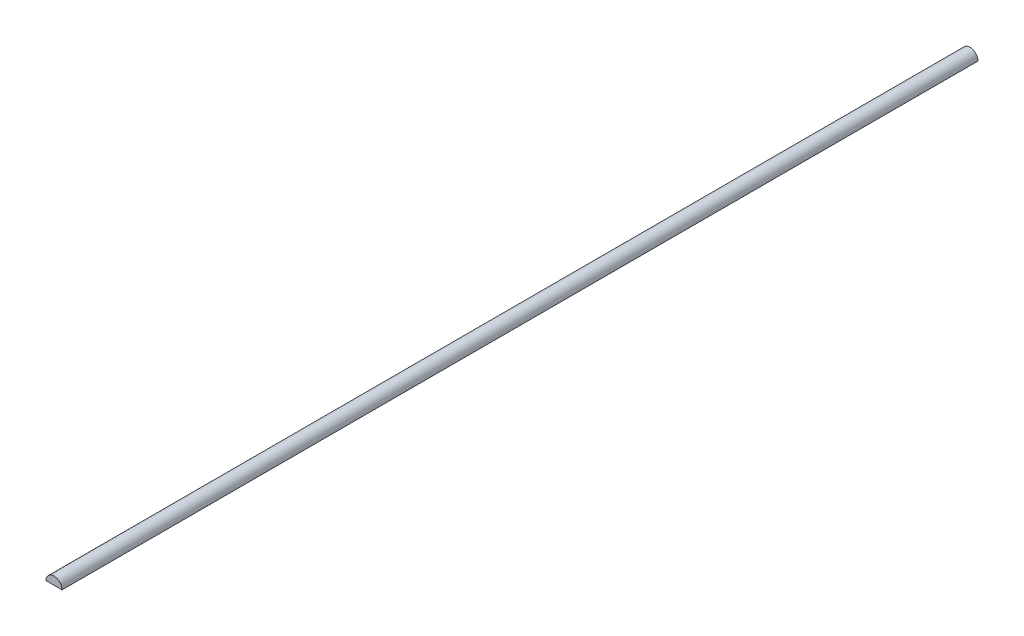
ISO-10303-21;
HEADER;
FILE_DESCRIPTION(('STEP AP214'),'2;1');
FILE_NAME('part.step','',(''),(''),'','','');
FILE_SCHEMA(('AUTOMOTIVE_DESIGN { 1 0 10303 214 1 1 1 1 }'));
ENDSEC;
DATA;
#1=APPLICATION_CONTEXT('core data for automotive mechanical design processes');
#2=APPLICATION_PROTOCOL_DEFINITION('international standard','automotive_design',2000,#1);
#3=PRODUCT_CONTEXT('',#1,'mechanical');
#4=PRODUCT('Part','Part','',(#3));
#5=PRODUCT_RELATED_PRODUCT_CATEGORY('part','',(#4));
#6=PRODUCT_DEFINITION_FORMATION('','',#4);
#7=PRODUCT_DEFINITION_CONTEXT('part definition',#1,'design');
#8=PRODUCT_DEFINITION('design','',#6,#7);
#9=PRODUCT_DEFINITION_SHAPE('','',#8);
#10=(LENGTH_UNIT() NAMED_UNIT(*) SI_UNIT(.MILLI.,.METRE.));
#11=(NAMED_UNIT(*) PLANE_ANGLE_UNIT() SI_UNIT($,.RADIAN.));
#12=(NAMED_UNIT(*) SI_UNIT($,.STERADIAN.) SOLID_ANGLE_UNIT());
#13=UNCERTAINTY_MEASURE_WITH_UNIT(LENGTH_MEASURE(1.E-05),#10,'distance_accuracy_value','');
#14=(GEOMETRIC_REPRESENTATION_CONTEXT(3) GLOBAL_UNCERTAINTY_ASSIGNED_CONTEXT((#13)) GLOBAL_UNIT_ASSIGNED_CONTEXT((#10,
#11,#12)) REPRESENTATION_CONTEXT('',''));
#15=CARTESIAN_POINT('',(0.,0.,0.));
#16=DIRECTION('',(0.,0.,1.));
#17=DIRECTION('',(1.,0.,0.));
#18=AXIS2_PLACEMENT_3D('',#15,#16,#17);
#19=CARTESIAN_POINT('',(0.,0.,1454.15));
#20=DIRECTION('',(0.,0.,-1.));
#21=DIRECTION('',(-1.,0.,0.));
#22=AXIS2_PLACEMENT_3D('',#19,#20,#21);
#23=CYLINDRICAL_SURFACE('',#22,12.7);
#24=CARTESIAN_POINT('',(0.,0.,0.));
#25=DIRECTION('',(0.,0.,1.));
#26=DIRECTION('',(1.,0.,0.));
#27=AXIS2_PLACEMENT_3D('',#24,#25,#26);
#28=CIRCLE('',#27,12.7);
#29=CARTESIAN_POINT('',(12.7,0.,0.));
#30=VERTEX_POINT('',#29);
#31=CARTESIAN_POINT('',(-12.7,0.,0.));
#32=VERTEX_POINT('',#31);
#33=EDGE_CURVE('E78',#30,#32,#28,.T.);
#34=ORIENTED_EDGE('',*,*,#33,.T.);
#35=DIRECTION('',(0.,0.,-1.));
#36=VECTOR('',#35,1.);
#37=CARTESIAN_POINT('',(-12.7,0.,1454.15));
#38=LINE('',#37,#36);
#39=CARTESIAN_POINT('',(-12.7,0.,1454.15));
#40=VERTEX_POINT('',#39);
#41=EDGE_CURVE('E11',#40,#32,#38,.T.);
#42=ORIENTED_EDGE('',*,*,#41,.F.);
#43=CARTESIAN_POINT('',(0.,0.,1454.15));
#44=DIRECTION('',(0.,0.,1.));
#45=DIRECTION('',(1.,0.,0.));
#46=AXIS2_PLACEMENT_3D('',#43,#44,#45);
#47=CIRCLE('',#46,12.7);
#48=CARTESIAN_POINT('',(12.7,0.,1454.15));
#49=VERTEX_POINT('',#48);
#50=EDGE_CURVE('E77',#49,#40,#47,.T.);
#51=ORIENTED_EDGE('',*,*,#50,.F.);
#52=DIRECTION('',(0.,0.,-1.));
#53=VECTOR('',#52,1.);
#54=CARTESIAN_POINT('',(12.7,0.,1454.15));
#55=LINE('',#54,#53);
#56=EDGE_CURVE('E54',#49,#30,#55,.T.);
#57=ORIENTED_EDGE('',*,*,#56,.T.);
#58=EDGE_LOOP('',(#34,#42,#51,#57));
#59=FACE_BOUND('',#58,.T.);
#60=ADVANCED_FACE('F45',(#59),#23,.T.);
#61=CARTESIAN_POINT('',(-12.7,0.,1454.15));
#62=DIRECTION('',(0.,1.,0.));
#63=DIRECTION('',(0.,0.,1.));
#64=AXIS2_PLACEMENT_3D('',#61,#62,#63);
#65=PLANE('',#64);
#66=DIRECTION('',(1.,0.,0.));
#67=VECTOR('',#66,1.);
#68=CARTESIAN_POINT('',(-12.7,0.,0.));
#69=LINE('',#68,#67);
#70=EDGE_CURVE('E69',#32,#30,#69,.T.);
#71=ORIENTED_EDGE('',*,*,#70,.T.);
#72=ORIENTED_EDGE('',*,*,#56,.F.);
#73=DIRECTION('',(1.,0.,0.));
#74=VECTOR('',#73,1.);
#75=CARTESIAN_POINT('',(-12.7,0.,1454.15));
#76=LINE('',#75,#74);
#77=EDGE_CURVE('E61',#40,#49,#76,.T.);
#78=ORIENTED_EDGE('',*,*,#77,.F.);
#79=ORIENTED_EDGE('',*,*,#41,.T.);
#80=EDGE_LOOP('',(#71,#72,#78,#79));
#81=FACE_BOUND('',#80,.T.);
#82=ADVANCED_FACE('F72',(#81),#65,.F.);
#83=CARTESIAN_POINT('',(0.,0.,1454.15));
#84=DIRECTION('',(0.,0.,1.));
#85=DIRECTION('',(1.,0.,0.));
#86=AXIS2_PLACEMENT_3D('',#83,#84,#85);
#87=PLANE('',#86);
#88=ORIENTED_EDGE('',*,*,#50,.T.);
#89=ORIENTED_EDGE('',*,*,#77,.T.);
#90=EDGE_LOOP('',(#88,#89));
#91=FACE_BOUND('',#90,.T.);
#92=ADVANCED_FACE('F89',(#91),#87,.T.);
#93=CARTESIAN_POINT('',(0.,0.,0.));
#94=DIRECTION('',(0.,0.,1.));
#95=DIRECTION('',(1.,0.,0.));
#96=AXIS2_PLACEMENT_3D('',#93,#94,#95);
#97=PLANE('',#96);
#98=ORIENTED_EDGE('',*,*,#33,.F.);
#99=ORIENTED_EDGE('',*,*,#70,.F.);
#100=EDGE_LOOP('',(#98,#99));
#101=FACE_BOUND('',#100,.T.);
#102=ADVANCED_FACE('F82',(#101),#97,.F.);
#103=CLOSED_SHELL('',(#60,#82,#92,#102));
#104=MANIFOLD_SOLID_BREP('B2',#103);
#105=ADVANCED_BREP_SHAPE_REPRESENTATION('',(#18,#104),#14);
#106=SHAPE_DEFINITION_REPRESENTATION(#9,#105);
ENDSEC;
END-ISO-10303-21;
